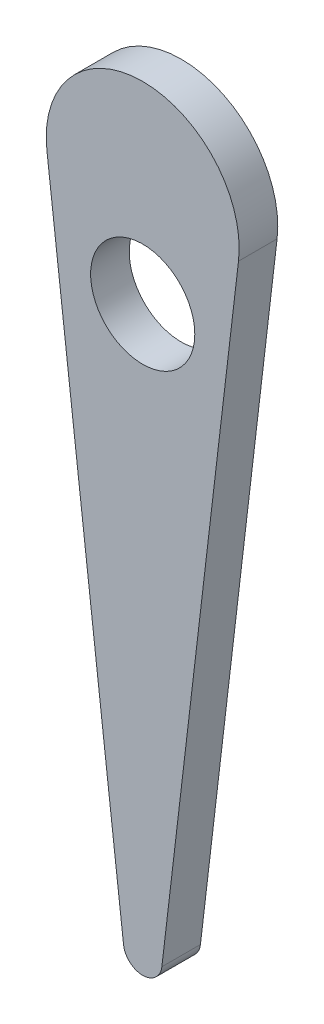
ISO-10303-21;
HEADER;
FILE_DESCRIPTION(('STEP AP214'),'2;1');
FILE_NAME('part.step','',(''),(''),'','','');
FILE_SCHEMA(('AUTOMOTIVE_DESIGN { 1 0 10303 214 1 1 1 1 }'));
ENDSEC;
DATA;
#1=APPLICATION_CONTEXT('core data for automotive mechanical design processes');
#2=APPLICATION_PROTOCOL_DEFINITION('international standard','automotive_design',2000,#1);
#3=PRODUCT_CONTEXT('',#1,'mechanical');
#4=PRODUCT('Part','Part','',(#3));
#5=PRODUCT_RELATED_PRODUCT_CATEGORY('part','',(#4));
#6=PRODUCT_DEFINITION_FORMATION('','',#4);
#7=PRODUCT_DEFINITION_CONTEXT('part definition',#1,'design');
#8=PRODUCT_DEFINITION('design','',#6,#7);
#9=PRODUCT_DEFINITION_SHAPE('','',#8);
#10=(LENGTH_UNIT() NAMED_UNIT(*) SI_UNIT(.MILLI.,.METRE.));
#11=(NAMED_UNIT(*) PLANE_ANGLE_UNIT() SI_UNIT($,.RADIAN.));
#12=(NAMED_UNIT(*) SI_UNIT($,.STERADIAN.) SOLID_ANGLE_UNIT());
#13=UNCERTAINTY_MEASURE_WITH_UNIT(LENGTH_MEASURE(1.E-05),#10,'distance_accuracy_value','');
#14=(GEOMETRIC_REPRESENTATION_CONTEXT(3) GLOBAL_UNCERTAINTY_ASSIGNED_CONTEXT((#13)) GLOBAL_UNIT_ASSIGNED_CONTEXT((#10,
#11,#12)) REPRESENTATION_CONTEXT('',''));
#15=CARTESIAN_POINT('',(0.,0.,0.));
#16=DIRECTION('',(0.,0.,1.));
#17=DIRECTION('',(1.,0.,0.));
#18=AXIS2_PLACEMENT_3D('',#15,#16,#17);
#19=CARTESIAN_POINT('',(0.,25.,10.));
#20=DIRECTION('',(0.,0.,-1.));
#21=DIRECTION('',(-1.,0.,0.));
#22=AXIS2_PLACEMENT_3D('',#19,#20,#21);
#23=PLANE('',#22);
#24=CARTESIAN_POINT('',(0.,25.,10.));
#25=DIRECTION('',(0.,0.,1.));
#26=DIRECTION('',(-1.,0.,0.));
#27=AXIS2_PLACEMENT_3D('',#24,#25,#26);
#28=CIRCLE('',#27,25.);
#29=CARTESIAN_POINT('',(24.8277156580791,22.0700622529524,10.));
#30=VERTEX_POINT('',#29);
#31=CARTESIAN_POINT('',(-24.8277156580791,22.0700622529524,10.));
#32=VERTEX_POINT('',#31);
#33=EDGE_CURVE('E87',#30,#32,#28,.T.);
#34=ORIENTED_EDGE('',*,*,#33,.T.);
#35=DIRECTION('',(0.117197509881903,-0.993108626323164,0.));
#36=VECTOR('',#35,1.);
#37=CARTESIAN_POINT('',(-24.8277156580791,22.0700622529524,10.));
#38=LINE('',#37,#36);
#39=CARTESIAN_POINT('',(-4.96554313161579,-146.238077514065,10.));
#40=VERTEX_POINT('',#39);
#41=EDGE_CURVE('E82',#32,#40,#38,.T.);
#42=ORIENTED_EDGE('',*,*,#41,.T.);
#43=CARTESIAN_POINT('',(0.,-145.652089964655,10.));
#44=DIRECTION('',(0.,0.,1.));
#45=DIRECTION('',(1.,0.,0.));
#46=AXIS2_PLACEMENT_3D('',#43,#44,#45);
#47=CIRCLE('',#46,4.99999999999999);
#48=CARTESIAN_POINT('',(4.96554313161583,-146.238077514065,10.));
#49=VERTEX_POINT('',#48);
#50=EDGE_CURVE('E85',#40,#49,#47,.T.);
#51=ORIENTED_EDGE('',*,*,#50,.T.);
#52=DIRECTION('',(0.117197509881902,0.993108626323164,0.));
#53=VECTOR('',#52,1.);
#54=CARTESIAN_POINT('',(24.8277156580791,22.0700622529524,10.));
#55=LINE('',#54,#53);
#56=EDGE_CURVE('E52',#49,#30,#55,.T.);
#57=ORIENTED_EDGE('',*,*,#56,.T.);
#58=EDGE_LOOP('',(#34,#42,#51,#57));
#59=FACE_BOUND('',#58,.T.);
#60=CARTESIAN_POINT('',(0.,0.,10.));
#61=DIRECTION('',(0.,0.,1.));
#62=DIRECTION('',(1.,0.,0.));
#63=AXIS2_PLACEMENT_3D('',#60,#61,#62);
#64=CIRCLE('',#63,13.5);
#65=CARTESIAN_POINT('',(13.5,0.,10.));
#66=VERTEX_POINT('',#65);
#67=EDGE_CURVE('E102',#66,#66,#64,.T.);
#68=ORIENTED_EDGE('',*,*,#67,.F.);
#69=EDGE_LOOP('',(#68));
#70=FACE_BOUND('',#69,.T.);
#71=ADVANCED_FACE('F35',(#59,#70),#23,.F.);
#72=CARTESIAN_POINT('',(0.,25.,0.));
#73=DIRECTION('',(0.,0.,-1.));
#74=DIRECTION('',(-1.,0.,0.));
#75=AXIS2_PLACEMENT_3D('',#72,#73,#74);
#76=PLANE('',#75);
#77=CARTESIAN_POINT('',(0.,25.,0.));
#78=DIRECTION('',(0.,0.,1.));
#79=DIRECTION('',(-1.,0.,0.));
#80=AXIS2_PLACEMENT_3D('',#77,#78,#79);
#81=CIRCLE('',#80,25.);
#82=CARTESIAN_POINT('',(24.8277156580791,22.0700622529524,0.));
#83=VERTEX_POINT('',#82);
#84=CARTESIAN_POINT('',(-24.8277156580791,22.0700622529524,0.));
#85=VERTEX_POINT('',#84);
#86=EDGE_CURVE('E99',#83,#85,#81,.T.);
#87=ORIENTED_EDGE('',*,*,#86,.F.);
#88=DIRECTION('',(0.117197509881902,0.993108626323164,0.));
#89=VECTOR('',#88,1.);
#90=CARTESIAN_POINT('',(24.8277156580791,22.0700622529524,0.));
#91=LINE('',#90,#89);
#92=CARTESIAN_POINT('',(4.96554313161583,-146.238077514065,0.));
#93=VERTEX_POINT('',#92);
#94=EDGE_CURVE('E75',#93,#83,#91,.T.);
#95=ORIENTED_EDGE('',*,*,#94,.F.);
#96=CARTESIAN_POINT('',(0.,-145.652089964655,0.));
#97=DIRECTION('',(0.,0.,1.));
#98=DIRECTION('',(1.,0.,0.));
#99=AXIS2_PLACEMENT_3D('',#96,#97,#98);
#100=CIRCLE('',#99,4.99999999999999);
#101=CARTESIAN_POINT('',(-4.96554313161579,-146.238077514065,0.));
#102=VERTEX_POINT('',#101);
#103=EDGE_CURVE('E69',#102,#93,#100,.T.);
#104=ORIENTED_EDGE('',*,*,#103,.F.);
#105=DIRECTION('',(0.117197509881903,-0.993108626323164,0.));
#106=VECTOR('',#105,1.);
#107=CARTESIAN_POINT('',(-24.8277156580791,22.0700622529524,0.));
#108=LINE('',#107,#106);
#109=EDGE_CURVE('E91',#85,#102,#108,.T.);
#110=ORIENTED_EDGE('',*,*,#109,.F.);
#111=EDGE_LOOP('',(#87,#95,#104,#110));
#112=FACE_BOUND('',#111,.T.);
#113=CARTESIAN_POINT('',(0.,0.,0.));
#114=DIRECTION('',(0.,0.,1.));
#115=DIRECTION('',(1.,0.,0.));
#116=AXIS2_PLACEMENT_3D('',#113,#114,#115);
#117=CIRCLE('',#116,13.5);
#118=CARTESIAN_POINT('',(13.5,0.,0.));
#119=VERTEX_POINT('',#118);
#120=EDGE_CURVE('E114',#119,#119,#117,.T.);
#121=ORIENTED_EDGE('',*,*,#120,.T.);
#122=EDGE_LOOP('',(#121));
#123=FACE_BOUND('',#122,.T.);
#124=ADVANCED_FACE('F110',(#112,#123),#76,.T.);
#125=CARTESIAN_POINT('',(0.,25.,10.));
#126=DIRECTION('',(0.,0.,-1.));
#127=DIRECTION('',(-1.,0.,0.));
#128=AXIS2_PLACEMENT_3D('',#125,#126,#127);
#129=CYLINDRICAL_SURFACE('',#128,25.);
#130=ORIENTED_EDGE('',*,*,#86,.T.);
#131=DIRECTION('',(0.,0.,-1.));
#132=VECTOR('',#131,1.);
#133=CARTESIAN_POINT('',(-24.8277156580791,22.0700622529524,10.));
#134=LINE('',#133,#132);
#135=EDGE_CURVE('E11',#32,#85,#134,.T.);
#136=ORIENTED_EDGE('',*,*,#135,.F.);
#137=ORIENTED_EDGE('',*,*,#33,.F.);
#138=DIRECTION('',(0.,0.,-1.));
#139=VECTOR('',#138,1.);
#140=CARTESIAN_POINT('',(24.8277156580791,22.0700622529524,10.));
#141=LINE('',#140,#139);
#142=EDGE_CURVE('E95',#30,#83,#141,.T.);
#143=ORIENTED_EDGE('',*,*,#142,.T.);
#144=EDGE_LOOP('',(#130,#136,#137,#143));
#145=FACE_BOUND('',#144,.T.);
#146=ADVANCED_FACE('F37',(#145),#129,.T.);
#147=CARTESIAN_POINT('',(-24.8277156580791,22.0700622529524,10.));
#148=DIRECTION('',(0.993108626323164,0.117197509881903,0.));
#149=DIRECTION('',(-0.117197509881903,0.993108626323164,0.));
#150=AXIS2_PLACEMENT_3D('',#147,#148,#149);
#151=PLANE('',#150);
#152=ORIENTED_EDGE('',*,*,#109,.T.);
#153=DIRECTION('',(0.,0.,-1.));
#154=VECTOR('',#153,1.);
#155=CARTESIAN_POINT('',(-4.96554313161579,-146.238077514065,10.));
#156=LINE('',#155,#154);
#157=EDGE_CURVE('E44',#40,#102,#156,.T.);
#158=ORIENTED_EDGE('',*,*,#157,.F.);
#159=ORIENTED_EDGE('',*,*,#41,.F.);
#160=ORIENTED_EDGE('',*,*,#135,.T.);
#161=EDGE_LOOP('',(#152,#158,#159,#160));
#162=FACE_BOUND('',#161,.T.);
#163=ADVANCED_FACE('F90',(#162),#151,.F.);
#164=CARTESIAN_POINT('',(0.,-145.652089964655,10.));
#165=DIRECTION('',(0.,0.,-1.));
#166=DIRECTION('',(-1.,0.,0.));
#167=AXIS2_PLACEMENT_3D('',#164,#165,#166);
#168=CYLINDRICAL_SURFACE('',#167,4.99999999999999);
#169=ORIENTED_EDGE('',*,*,#103,.T.);
#170=DIRECTION('',(0.,0.,-1.));
#171=VECTOR('',#170,1.);
#172=CARTESIAN_POINT('',(4.96554313161583,-146.238077514065,10.));
#173=LINE('',#172,#171);
#174=EDGE_CURVE('E92',#49,#93,#173,.T.);
#175=ORIENTED_EDGE('',*,*,#174,.F.);
#176=ORIENTED_EDGE('',*,*,#50,.F.);
#177=ORIENTED_EDGE('',*,*,#157,.T.);
#178=EDGE_LOOP('',(#169,#175,#176,#177));
#179=FACE_BOUND('',#178,.T.);
#180=ADVANCED_FACE('F93',(#179),#168,.T.);
#181=CARTESIAN_POINT('',(24.8277156580791,22.0700622529524,10.));
#182=DIRECTION('',(-0.993108626323164,0.117197509881902,0.));
#183=DIRECTION('',(-0.117197509881902,-0.993108626323164,0.));
#184=AXIS2_PLACEMENT_3D('',#181,#182,#183);
#185=PLANE('',#184);
#186=ORIENTED_EDGE('',*,*,#94,.T.);
#187=ORIENTED_EDGE('',*,*,#142,.F.);
#188=ORIENTED_EDGE('',*,*,#56,.F.);
#189=ORIENTED_EDGE('',*,*,#174,.T.);
#190=EDGE_LOOP('',(#186,#187,#188,#189));
#191=FACE_BOUND('',#190,.T.);
#192=ADVANCED_FACE('F107',(#191),#185,.F.);
#193=CARTESIAN_POINT('',(0.,0.,10.));
#194=DIRECTION('',(0.,0.,-1.));
#195=DIRECTION('',(-1.,0.,0.));
#196=AXIS2_PLACEMENT_3D('',#193,#194,#195);
#197=CYLINDRICAL_SURFACE('',#196,13.5);
#198=ORIENTED_EDGE('',*,*,#67,.T.);
#199=EDGE_LOOP('',(#198));
#200=FACE_BOUND('',#199,.T.);
#201=ORIENTED_EDGE('',*,*,#120,.F.);
#202=EDGE_LOOP('',(#201));
#203=FACE_BOUND('',#202,.T.);
#204=ADVANCED_FACE('F120',(#200,#203),#197,.F.);
#205=CLOSED_SHELL('',(#71,#124,#146,#163,#180,#192,#204));
#206=MANIFOLD_SOLID_BREP('B2',#205);
#207=ADVANCED_BREP_SHAPE_REPRESENTATION('',(#18,#206),#14);
#208=SHAPE_DEFINITION_REPRESENTATION(#9,#207);
ENDSEC;
END-ISO-10303-21;
